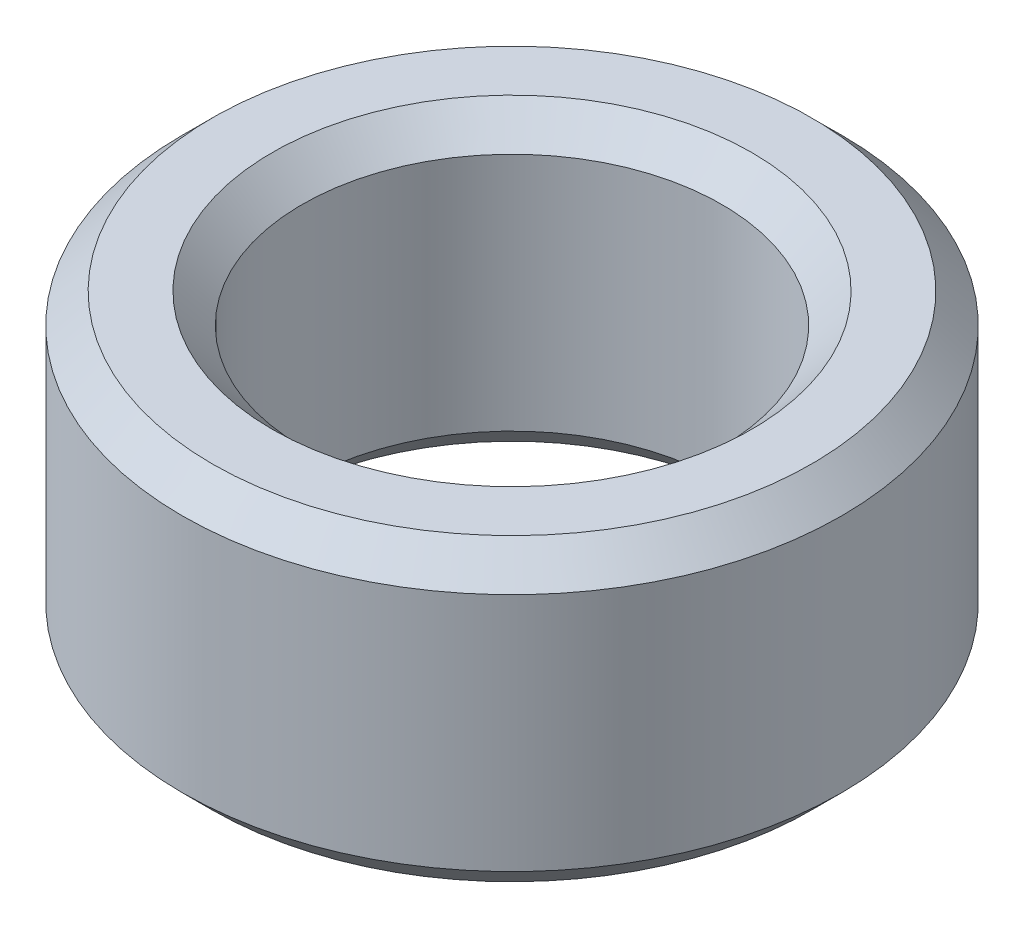
ISO-10303-21;
HEADER;
FILE_DESCRIPTION(('STEP AP214'),'2;1');
FILE_NAME('part.step','',(''),(''),'','','');
FILE_SCHEMA(('AUTOMOTIVE_DESIGN { 1 0 10303 214 1 1 1 1 }'));
ENDSEC;
DATA;
#1=APPLICATION_CONTEXT('core data for automotive mechanical design processes');
#2=APPLICATION_PROTOCOL_DEFINITION('international standard','automotive_design',2000,#1);
#3=PRODUCT_CONTEXT('',#1,'mechanical');
#4=PRODUCT('Part','Part','',(#3));
#5=PRODUCT_RELATED_PRODUCT_CATEGORY('part','',(#4));
#6=PRODUCT_DEFINITION_FORMATION('','',#4);
#7=PRODUCT_DEFINITION_CONTEXT('part definition',#1,'design');
#8=PRODUCT_DEFINITION('design','',#6,#7);
#9=PRODUCT_DEFINITION_SHAPE('','',#8);
#10=(LENGTH_UNIT() NAMED_UNIT(*) SI_UNIT(.MILLI.,.METRE.));
#11=(NAMED_UNIT(*) PLANE_ANGLE_UNIT() SI_UNIT($,.RADIAN.));
#12=(NAMED_UNIT(*) SI_UNIT($,.STERADIAN.) SOLID_ANGLE_UNIT());
#13=UNCERTAINTY_MEASURE_WITH_UNIT(LENGTH_MEASURE(1.E-05),#10,'distance_accuracy_value','');
#14=(GEOMETRIC_REPRESENTATION_CONTEXT(3) GLOBAL_UNCERTAINTY_ASSIGNED_CONTEXT((#13)) GLOBAL_UNIT_ASSIGNED_CONTEXT((#10,
#11,#12)) REPRESENTATION_CONTEXT('',''));
#15=CARTESIAN_POINT('',(0.,0.,0.));
#16=DIRECTION('',(0.,0.,1.));
#17=DIRECTION('',(1.,0.,0.));
#18=AXIS2_PLACEMENT_3D('',#15,#16,#17);
#19=CARTESIAN_POINT('',(0.,2.5,0.));
#20=DIRECTION('',(0.,1.,0.));
#21=DIRECTION('',(0.,0.,1.));
#22=AXIS2_PLACEMENT_3D('',#19,#20,#21);
#23=PLANE('',#22);
#24=CARTESIAN_POINT('',(0.,2.5,0.));
#25=DIRECTION('',(0.,1.,0.));
#26=DIRECTION('',(0.,0.,1.));
#27=AXIS2_PLACEMENT_3D('',#24,#25,#26);
#28=CIRCLE('',#27,2.);
#29=CARTESIAN_POINT('',(0.,2.5,2.));
#30=VERTEX_POINT('',#29);
#31=EDGE_CURVE('E49',#30,#30,#28,.F.);
#32=ORIENTED_EDGE('',*,*,#31,.T.);
#33=EDGE_LOOP('',(#32));
#34=FACE_BOUND('',#33,.T.);
#35=CARTESIAN_POINT('',(0.,2.5,0.));
#36=DIRECTION('',(0.,1.,0.));
#37=DIRECTION('',(0.,0.,1.));
#38=AXIS2_PLACEMENT_3D('',#35,#36,#37);
#39=CIRCLE('',#38,2.5);
#40=CARTESIAN_POINT('',(0.,2.5,2.5));
#41=VERTEX_POINT('',#40);
#42=EDGE_CURVE('E67',#41,#41,#39,.T.);
#43=ORIENTED_EDGE('',*,*,#42,.T.);
#44=EDGE_LOOP('',(#43));
#45=FACE_BOUND('',#44,.T.);
#46=ADVANCED_FACE('F37',(#34,#45),#23,.T.);
#47=CARTESIAN_POINT('',(0.,0.,0.));
#48=DIRECTION('',(0.,1.,0.));
#49=DIRECTION('',(0.,0.,1.));
#50=AXIS2_PLACEMENT_3D('',#47,#48,#49);
#51=PLANE('',#50);
#52=CARTESIAN_POINT('',(0.,0.,0.));
#53=DIRECTION('',(0.,1.,0.));
#54=DIRECTION('',(0.,0.,1.));
#55=AXIS2_PLACEMENT_3D('',#52,#53,#54);
#56=CIRCLE('',#55,2.);
#57=CARTESIAN_POINT('',(0.,0.,2.));
#58=VERTEX_POINT('',#57);
#59=EDGE_CURVE('E45',#58,#58,#56,.T.);
#60=ORIENTED_EDGE('',*,*,#59,.T.);
#61=EDGE_LOOP('',(#60));
#62=FACE_BOUND('',#61,.T.);
#63=CARTESIAN_POINT('',(0.,0.,0.));
#64=DIRECTION('',(0.,1.,0.));
#65=DIRECTION('',(0.,0.,1.));
#66=AXIS2_PLACEMENT_3D('',#63,#64,#65);
#67=CIRCLE('',#66,2.5);
#68=CARTESIAN_POINT('',(0.,0.,2.5));
#69=VERTEX_POINT('',#68);
#70=EDGE_CURVE('E58',#69,#69,#67,.F.);
#71=ORIENTED_EDGE('',*,*,#70,.T.);
#72=EDGE_LOOP('',(#71));
#73=FACE_BOUND('',#72,.T.);
#74=ADVANCED_FACE('F91',(#62,#73),#51,.F.);
#75=CARTESIAN_POINT('',(0.,2.5,0.));
#76=DIRECTION('',(0.,-1.,0.));
#77=DIRECTION('',(0.,0.,-1.));
#78=AXIS2_PLACEMENT_3D('',#75,#76,#77);
#79=CYLINDRICAL_SURFACE('',#78,2.75);
#80=CARTESIAN_POINT('',(0.,0.250000000000001,0.));
#81=DIRECTION('',(0.,1.,0.));
#82=DIRECTION('',(0.,0.,1.));
#83=AXIS2_PLACEMENT_3D('',#80,#81,#82);
#84=CIRCLE('',#83,2.75);
#85=CARTESIAN_POINT('',(0.,0.250000000000001,2.75));
#86=VERTEX_POINT('',#85);
#87=EDGE_CURVE('E61',#86,#86,#84,.T.);
#88=ORIENTED_EDGE('',*,*,#87,.T.);
#89=EDGE_LOOP('',(#88));
#90=FACE_BOUND('',#89,.T.);
#91=CARTESIAN_POINT('',(0.,2.25,0.));
#92=DIRECTION('',(0.,1.,0.));
#93=DIRECTION('',(0.,0.,1.));
#94=AXIS2_PLACEMENT_3D('',#91,#92,#93);
#95=CIRCLE('',#94,2.75);
#96=CARTESIAN_POINT('',(0.,2.25,2.75));
#97=VERTEX_POINT('',#96);
#98=EDGE_CURVE('E64',#97,#97,#95,.F.);
#99=ORIENTED_EDGE('',*,*,#98,.T.);
#100=EDGE_LOOP('',(#99));
#101=FACE_BOUND('',#100,.T.);
#102=ADVANCED_FACE('F85',(#90,#101),#79,.T.);
#103=CARTESIAN_POINT('',(0.,2.5,0.));
#104=DIRECTION('',(0.,-1.,0.));
#105=DIRECTION('',(0.,0.,-1.));
#106=AXIS2_PLACEMENT_3D('',#103,#104,#105);
#107=CYLINDRICAL_SURFACE('',#106,1.75);
#108=CARTESIAN_POINT('',(0.,0.250000000000001,0.));
#109=DIRECTION('',(0.,1.,0.));
#110=DIRECTION('',(0.,0.,1.));
#111=AXIS2_PLACEMENT_3D('',#108,#109,#110);
#112=CIRCLE('',#111,1.75);
#113=CARTESIAN_POINT('',(0.,0.250000000000001,1.75));
#114=VERTEX_POINT('',#113);
#115=EDGE_CURVE('E10',#114,#114,#112,.F.);
#116=ORIENTED_EDGE('',*,*,#115,.T.);
#117=EDGE_LOOP('',(#116));
#118=FACE_BOUND('',#117,.T.);
#119=CARTESIAN_POINT('',(0.,2.25,0.));
#120=DIRECTION('',(0.,1.,0.));
#121=DIRECTION('',(0.,0.,1.));
#122=AXIS2_PLACEMENT_3D('',#119,#120,#121);
#123=CIRCLE('',#122,1.75);
#124=CARTESIAN_POINT('',(0.,2.25,1.75));
#125=VERTEX_POINT('',#124);
#126=EDGE_CURVE('E53',#125,#125,#123,.T.);
#127=ORIENTED_EDGE('',*,*,#126,.T.);
#128=EDGE_LOOP('',(#127));
#129=FACE_BOUND('',#128,.T.);
#130=ADVANCED_FACE('F75',(#118,#129),#107,.F.);
#131=CARTESIAN_POINT('',(0.,2.5,0.));
#132=DIRECTION('',(0.,-1.,0.));
#133=DIRECTION('',(0.,0.,-1.));
#134=AXIS2_PLACEMENT_3D('',#131,#132,#133);
#135=CONICAL_SURFACE('',#134,2.5,0.785398163397451);
#136=ORIENTED_EDGE('',*,*,#98,.F.);
#137=EDGE_LOOP('',(#136));
#138=FACE_BOUND('',#137,.T.);
#139=ORIENTED_EDGE('',*,*,#42,.F.);
#140=EDGE_LOOP('',(#139));
#141=FACE_BOUND('',#140,.T.);
#142=ADVANCED_FACE('F72',(#138,#141),#135,.T.);
#143=CARTESIAN_POINT('',(0.,0.250000000000001,0.));
#144=DIRECTION('',(0.,1.,0.));
#145=DIRECTION('',(0.,0.,1.));
#146=AXIS2_PLACEMENT_3D('',#143,#144,#145);
#147=CONICAL_SURFACE('',#146,2.75,0.78539816339745);
#148=ORIENTED_EDGE('',*,*,#70,.F.);
#149=EDGE_LOOP('',(#148));
#150=FACE_BOUND('',#149,.T.);
#151=ORIENTED_EDGE('',*,*,#87,.F.);
#152=EDGE_LOOP('',(#151));
#153=FACE_BOUND('',#152,.T.);
#154=ADVANCED_FACE('F74',(#150,#153),#147,.T.);
#155=CARTESIAN_POINT('',(0.,2.25,0.));
#156=DIRECTION('',(0.,1.,0.));
#157=DIRECTION('',(0.,0.,1.));
#158=AXIS2_PLACEMENT_3D('',#155,#156,#157);
#159=CONICAL_SURFACE('',#158,1.75,0.785398163397449);
#160=ORIENTED_EDGE('',*,*,#31,.F.);
#161=EDGE_LOOP('',(#160));
#162=FACE_BOUND('',#161,.T.);
#163=ORIENTED_EDGE('',*,*,#126,.F.);
#164=EDGE_LOOP('',(#163));
#165=FACE_BOUND('',#164,.T.);
#166=ADVANCED_FACE('F82',(#162,#165),#159,.F.);
#167=CARTESIAN_POINT('',(0.,0.,0.));
#168=DIRECTION('',(0.,-1.,0.));
#169=DIRECTION('',(0.,0.,-1.));
#170=AXIS2_PLACEMENT_3D('',#167,#168,#169);
#171=CONICAL_SURFACE('',#170,2.,0.785398163397447);
#172=ORIENTED_EDGE('',*,*,#115,.F.);
#173=EDGE_LOOP('',(#172));
#174=FACE_BOUND('',#173,.T.);
#175=ORIENTED_EDGE('',*,*,#59,.F.);
#176=EDGE_LOOP('',(#175));
#177=FACE_BOUND('',#176,.T.);
#178=ADVANCED_FACE('F40',(#174,#177),#171,.F.);
#179=CLOSED_SHELL('',(#46,#74,#102,#130,#142,#154,#166,#178));
#180=MANIFOLD_SOLID_BREP('B2',#179);
#181=ADVANCED_BREP_SHAPE_REPRESENTATION('',(#18,#180),#14);
#182=SHAPE_DEFINITION_REPRESENTATION(#9,#181);
ENDSEC;
END-ISO-10303-21;
